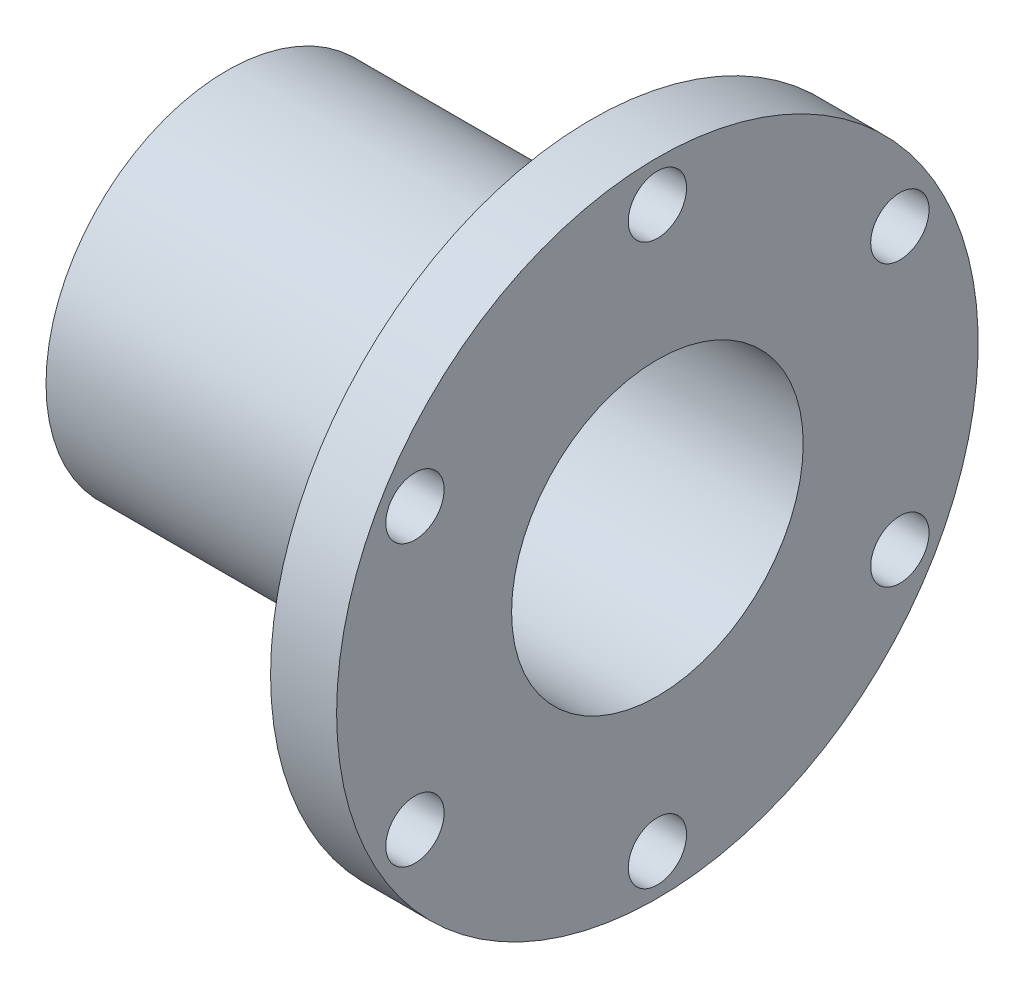
ISO-10303-21;
HEADER;
FILE_DESCRIPTION(('STEP AP214'),'2;1');
FILE_NAME('part.step','',(''),(''),'','','');
FILE_SCHEMA(('AUTOMOTIVE_DESIGN { 1 0 10303 214 1 1 1 1 }'));
ENDSEC;
DATA;
#1=APPLICATION_CONTEXT('core data for automotive mechanical design processes');
#2=APPLICATION_PROTOCOL_DEFINITION('international standard','automotive_design',2000,#1);
#3=PRODUCT_CONTEXT('',#1,'mechanical');
#4=PRODUCT('Part','Part','',(#3));
#5=PRODUCT_RELATED_PRODUCT_CATEGORY('part','',(#4));
#6=PRODUCT_DEFINITION_FORMATION('','',#4);
#7=PRODUCT_DEFINITION_CONTEXT('part definition',#1,'design');
#8=PRODUCT_DEFINITION('design','',#6,#7);
#9=PRODUCT_DEFINITION_SHAPE('','',#8);
#10=(LENGTH_UNIT() NAMED_UNIT(*) SI_UNIT(.MILLI.,.METRE.));
#11=(NAMED_UNIT(*) PLANE_ANGLE_UNIT() SI_UNIT($,.RADIAN.));
#12=(NAMED_UNIT(*) SI_UNIT($,.STERADIAN.) SOLID_ANGLE_UNIT());
#13=UNCERTAINTY_MEASURE_WITH_UNIT(LENGTH_MEASURE(1.E-05),#10,'distance_accuracy_value','');
#14=(GEOMETRIC_REPRESENTATION_CONTEXT(3) GLOBAL_UNCERTAINTY_ASSIGNED_CONTEXT((#13)) GLOBAL_UNIT_ASSIGNED_CONTEXT((#10,
#11,#12)) REPRESENTATION_CONTEXT('',''));
#15=CARTESIAN_POINT('',(0.,0.,0.));
#16=DIRECTION('',(0.,0.,1.));
#17=DIRECTION('',(1.,0.,0.));
#18=AXIS2_PLACEMENT_3D('',#15,#16,#17);
#19=CARTESIAN_POINT('',(-22.6457399103139,110.,0.));
#20=DIRECTION('',(1.,0.,0.));
#21=DIRECTION('',(0.,0.,-1.));
#22=AXIS2_PLACEMENT_3D('',#19,#20,#21);
#23=PLANE('',#22);
#24=CARTESIAN_POINT('',(-22.6457399103139,48.000000000001,-83.1384387633056));
#25=DIRECTION('',(1.,0.,0.));
#26=DIRECTION('',(0.,0.,-1.));
#27=AXIS2_PLACEMENT_3D('',#24,#25,#26);
#28=CIRCLE('',#27,10.);
#29=CARTESIAN_POINT('',(-22.6457399103139,48.000000000001,-93.1384387633055));
#30=VERTEX_POINT('',#29);
#31=EDGE_CURVE('E69',#30,#30,#28,.T.);
#32=ORIENTED_EDGE('',*,*,#31,.T.);
#33=EDGE_LOOP('',(#32));
#34=FACE_BOUND('',#33,.T.);
#35=CARTESIAN_POINT('',(-22.6457399103139,-47.9999999999992,-83.1384387633066));
#36=DIRECTION('',(1.,0.,0.));
#37=DIRECTION('',(0.,0.,-1.));
#38=AXIS2_PLACEMENT_3D('',#35,#36,#37);
#39=CIRCLE('',#38,10.);
#40=CARTESIAN_POINT('',(-22.6457399103139,-47.9999999999992,-93.1384387633066));
#41=VERTEX_POINT('',#40);
#42=EDGE_CURVE('E72',#41,#41,#39,.T.);
#43=ORIENTED_EDGE('',*,*,#42,.T.);
#44=EDGE_LOOP('',(#43));
#45=FACE_BOUND('',#44,.T.);
#46=CARTESIAN_POINT('',(-22.6457399103139,-96.,0.));
#47=DIRECTION('',(1.,0.,0.));
#48=DIRECTION('',(0.,0.,-1.));
#49=AXIS2_PLACEMENT_3D('',#46,#47,#48);
#50=CIRCLE('',#49,10.);
#51=CARTESIAN_POINT('',(-22.6457399103139,-96.,-10.));
#52=VERTEX_POINT('',#51);
#53=EDGE_CURVE('E75',#52,#52,#50,.T.);
#54=ORIENTED_EDGE('',*,*,#53,.T.);
#55=EDGE_LOOP('',(#54));
#56=FACE_BOUND('',#55,.T.);
#57=CARTESIAN_POINT('',(-22.6457399103139,-48.0000000000004,83.1384387633059));
#58=DIRECTION('',(1.,0.,0.));
#59=DIRECTION('',(0.,0.,-1.));
#60=AXIS2_PLACEMENT_3D('',#57,#58,#59);
#61=CIRCLE('',#60,10.);
#62=CARTESIAN_POINT('',(-22.6457399103139,-48.0000000000004,73.1384387633059));
#63=VERTEX_POINT('',#62);
#64=EDGE_CURVE('E78',#63,#63,#61,.T.);
#65=ORIENTED_EDGE('',*,*,#64,.T.);
#66=EDGE_LOOP('',(#65));
#67=FACE_BOUND('',#66,.T.);
#68=CARTESIAN_POINT('',(-22.6457399103139,47.9999999999998,83.1384387633062));
#69=DIRECTION('',(1.,0.,0.));
#70=DIRECTION('',(0.,0.,-1.));
#71=AXIS2_PLACEMENT_3D('',#68,#69,#70);
#72=CIRCLE('',#71,10.);
#73=CARTESIAN_POINT('',(-22.6457399103139,47.9999999999998,73.1384387633062));
#74=VERTEX_POINT('',#73);
#75=EDGE_CURVE('E81',#74,#74,#72,.T.);
#76=ORIENTED_EDGE('',*,*,#75,.T.);
#77=EDGE_LOOP('',(#76));
#78=FACE_BOUND('',#77,.T.);
#79=CARTESIAN_POINT('',(-22.6457399103139,96.,0.));
#80=DIRECTION('',(1.,0.,0.));
#81=DIRECTION('',(0.,0.,-1.));
#82=AXIS2_PLACEMENT_3D('',#79,#80,#81);
#83=CIRCLE('',#82,10.);
#84=CARTESIAN_POINT('',(-22.6457399103139,96.,-10.));
#85=VERTEX_POINT('',#84);
#86=EDGE_CURVE('E63',#85,#85,#83,.T.);
#87=ORIENTED_EDGE('',*,*,#86,.T.);
#88=EDGE_LOOP('',(#87));
#89=FACE_BOUND('',#88,.T.);
#90=CARTESIAN_POINT('',(-22.6457399103139,0.,0.));
#91=DIRECTION('',(-1.,0.,0.));
#92=DIRECTION('',(0.,0.,1.));
#93=AXIS2_PLACEMENT_3D('',#90,#91,#92);
#94=CIRCLE('',#93,62.);
#95=CARTESIAN_POINT('',(-22.6457399103139,0.,62.));
#96=VERTEX_POINT('',#95);
#97=EDGE_CURVE('E60',#96,#96,#94,.T.);
#98=ORIENTED_EDGE('',*,*,#97,.F.);
#99=EDGE_LOOP('',(#98));
#100=FACE_BOUND('',#99,.T.);
#101=CARTESIAN_POINT('',(-22.6457399103139,0.,0.));
#102=DIRECTION('',(-1.,0.,0.));
#103=DIRECTION('',(0.,0.,1.));
#104=AXIS2_PLACEMENT_3D('',#101,#102,#103);
#105=CIRCLE('',#104,110.);
#106=CARTESIAN_POINT('',(-22.6457399103139,0.,110.));
#107=VERTEX_POINT('',#106);
#108=EDGE_CURVE('E10',#107,#107,#105,.T.);
#109=ORIENTED_EDGE('',*,*,#108,.T.);
#110=EDGE_LOOP('',(#109));
#111=FACE_BOUND('',#110,.T.);
#112=ADVANCED_FACE('F38',(#34,#45,#56,#67,#78,#89,#100,#111),#23,.F.);
#113=CARTESIAN_POINT('',(-203.363228699552,0.,0.));
#114=DIRECTION('',(-1.,0.,0.));
#115=DIRECTION('',(0.,0.,1.));
#116=AXIS2_PLACEMENT_3D('',#113,#114,#115);
#117=CYLINDRICAL_SURFACE('',#116,110.);
#118=ORIENTED_EDGE('',*,*,#108,.F.);
#119=EDGE_LOOP('',(#118));
#120=FACE_BOUND('',#119,.T.);
#121=CARTESIAN_POINT('',(0.,0.,0.));
#122=DIRECTION('',(-1.,0.,0.));
#123=DIRECTION('',(0.,0.,1.));
#124=AXIS2_PLACEMENT_3D('',#121,#122,#123);
#125=CIRCLE('',#124,110.);
#126=CARTESIAN_POINT('',(0.,0.,110.));
#127=VERTEX_POINT('',#126);
#128=EDGE_CURVE('E44',#127,#127,#125,.T.);
#129=ORIENTED_EDGE('',*,*,#128,.T.);
#130=EDGE_LOOP('',(#129));
#131=FACE_BOUND('',#130,.T.);
#132=ADVANCED_FACE('F107',(#120,#131),#117,.T.);
#133=CARTESIAN_POINT('',(0.,50.,0.));
#134=DIRECTION('',(-1.,0.,0.));
#135=DIRECTION('',(0.,0.,1.));
#136=AXIS2_PLACEMENT_3D('',#133,#134,#135);
#137=PLANE('',#136);
#138=CARTESIAN_POINT('',(0.,48.000000000001,-83.1384387633056));
#139=DIRECTION('',(1.,0.,0.));
#140=DIRECTION('',(0.,-0.866025403784433,-0.50000000000001));
#141=AXIS2_PLACEMENT_3D('',#138,#139,#140);
#142=CIRCLE('',#141,10.);
#143=CARTESIAN_POINT('',(0.,39.3397459621566,-88.1384387633057));
#144=VERTEX_POINT('',#143);
#145=EDGE_CURVE('E88',#144,#144,#142,.T.);
#146=ORIENTED_EDGE('',*,*,#145,.F.);
#147=EDGE_LOOP('',(#146));
#148=FACE_BOUND('',#147,.T.);
#149=CARTESIAN_POINT('',(0.,-47.9999999999992,-83.1384387633066));
#150=DIRECTION('',(1.,0.,0.));
#151=DIRECTION('',(0.,-0.866025403784443,0.499999999999992));
#152=AXIS2_PLACEMENT_3D('',#149,#150,#151);
#153=CIRCLE('',#152,10.);
#154=CARTESIAN_POINT('',(0.,-56.6602540378437,-78.1384387633066));
#155=VERTEX_POINT('',#154);
#156=EDGE_CURVE('E91',#155,#155,#153,.T.);
#157=ORIENTED_EDGE('',*,*,#156,.F.);
#158=EDGE_LOOP('',(#157));
#159=FACE_BOUND('',#158,.T.);
#160=CARTESIAN_POINT('',(0.,-96.,0.));
#161=DIRECTION('',(1.,0.,0.));
#162=DIRECTION('',(0.,0.,1.));
#163=AXIS2_PLACEMENT_3D('',#160,#161,#162);
#164=CIRCLE('',#163,10.);
#165=CARTESIAN_POINT('',(0.,-96.,10.));
#166=VERTEX_POINT('',#165);
#167=EDGE_CURVE('E94',#166,#166,#164,.T.);
#168=ORIENTED_EDGE('',*,*,#167,.F.);
#169=EDGE_LOOP('',(#168));
#170=FACE_BOUND('',#169,.T.);
#171=CARTESIAN_POINT('',(0.,-48.0000000000004,83.1384387633059));
#172=DIRECTION('',(1.,0.,0.));
#173=DIRECTION('',(0.,0.866025403784436,0.500000000000004));
#174=AXIS2_PLACEMENT_3D('',#171,#172,#173);
#175=CIRCLE('',#174,10.);
#176=CARTESIAN_POINT('',(0.,-39.339745962156,88.1384387633059));
#177=VERTEX_POINT('',#176);
#178=EDGE_CURVE('E87',#177,#177,#175,.T.);
#179=ORIENTED_EDGE('',*,*,#178,.F.);
#180=EDGE_LOOP('',(#179));
#181=FACE_BOUND('',#180,.T.);
#182=CARTESIAN_POINT('',(0.,47.9999999999998,83.1384387633062));
#183=DIRECTION('',(1.,0.,0.));
#184=DIRECTION('',(0.,0.86602540378444,-0.499999999999998));
#185=AXIS2_PLACEMENT_3D('',#182,#183,#184);
#186=CIRCLE('',#185,10.);
#187=CARTESIAN_POINT('',(0.,56.6602540378442,78.1384387633062));
#188=VERTEX_POINT('',#187);
#189=EDGE_CURVE('E84',#188,#188,#186,.T.);
#190=ORIENTED_EDGE('',*,*,#189,.F.);
#191=EDGE_LOOP('',(#190));
#192=FACE_BOUND('',#191,.T.);
#193=CARTESIAN_POINT('',(0.,96.,0.));
#194=DIRECTION('',(1.,0.,0.));
#195=DIRECTION('',(0.,0.,-1.));
#196=AXIS2_PLACEMENT_3D('',#193,#194,#195);
#197=CIRCLE('',#196,10.);
#198=CARTESIAN_POINT('',(0.,96.,-10.));
#199=VERTEX_POINT('',#198);
#200=EDGE_CURVE('E66',#199,#199,#197,.T.);
#201=ORIENTED_EDGE('',*,*,#200,.F.);
#202=EDGE_LOOP('',(#201));
#203=FACE_BOUND('',#202,.T.);
#204=ORIENTED_EDGE('',*,*,#128,.F.);
#205=EDGE_LOOP('',(#204));
#206=FACE_BOUND('',#205,.T.);
#207=CARTESIAN_POINT('',(0.,0.,0.));
#208=DIRECTION('',(-1.,0.,0.));
#209=DIRECTION('',(0.,0.,1.));
#210=AXIS2_PLACEMENT_3D('',#207,#208,#209);
#211=CIRCLE('',#210,50.);
#212=CARTESIAN_POINT('',(0.,0.,50.));
#213=VERTEX_POINT('',#212);
#214=EDGE_CURVE('E48',#213,#213,#211,.T.);
#215=ORIENTED_EDGE('',*,*,#214,.T.);
#216=EDGE_LOOP('',(#215));
#217=FACE_BOUND('',#216,.T.);
#218=ADVANCED_FACE('F103',(#148,#159,#170,#181,#192,#203,#206,#217),#137,.F.);
#219=CARTESIAN_POINT('',(-203.363228699552,0.,0.));
#220=DIRECTION('',(-1.,0.,0.));
#221=DIRECTION('',(0.,0.,1.));
#222=AXIS2_PLACEMENT_3D('',#219,#220,#221);
#223=CYLINDRICAL_SURFACE('',#222,50.);
#224=ORIENTED_EDGE('',*,*,#214,.F.);
#225=EDGE_LOOP('',(#224));
#226=FACE_BOUND('',#225,.T.);
#227=CARTESIAN_POINT('',(-147.645739910314,0.,0.));
#228=DIRECTION('',(-1.,0.,0.));
#229=DIRECTION('',(0.,0.,1.));
#230=AXIS2_PLACEMENT_3D('',#227,#228,#229);
#231=CIRCLE('',#230,50.);
#232=CARTESIAN_POINT('',(-147.645739910314,0.,50.));
#233=VERTEX_POINT('',#232);
#234=EDGE_CURVE('E52',#233,#233,#231,.T.);
#235=ORIENTED_EDGE('',*,*,#234,.T.);
#236=EDGE_LOOP('',(#235));
#237=FACE_BOUND('',#236,.T.);
#238=ADVANCED_FACE('F106',(#226,#237),#223,.F.);
#239=CARTESIAN_POINT('',(-147.645739910314,62.,0.));
#240=DIRECTION('',(1.,0.,0.));
#241=DIRECTION('',(0.,0.,-1.));
#242=AXIS2_PLACEMENT_3D('',#239,#240,#241);
#243=PLANE('',#242);
#244=ORIENTED_EDGE('',*,*,#234,.F.);
#245=EDGE_LOOP('',(#244));
#246=FACE_BOUND('',#245,.T.);
#247=CARTESIAN_POINT('',(-147.645739910314,0.,0.));
#248=DIRECTION('',(-1.,0.,0.));
#249=DIRECTION('',(0.,0.,1.));
#250=AXIS2_PLACEMENT_3D('',#247,#248,#249);
#251=CIRCLE('',#250,62.);
#252=CARTESIAN_POINT('',(-147.645739910314,0.,62.));
#253=VERTEX_POINT('',#252);
#254=EDGE_CURVE('E57',#253,#253,#251,.T.);
#255=ORIENTED_EDGE('',*,*,#254,.T.);
#256=EDGE_LOOP('',(#255));
#257=FACE_BOUND('',#256,.T.);
#258=ADVANCED_FACE('F119',(#246,#257),#243,.F.);
#259=CARTESIAN_POINT('',(-203.363228699552,0.,0.));
#260=DIRECTION('',(-1.,0.,0.));
#261=DIRECTION('',(0.,0.,1.));
#262=AXIS2_PLACEMENT_3D('',#259,#260,#261);
#263=CYLINDRICAL_SURFACE('',#262,62.);
#264=ORIENTED_EDGE('',*,*,#254,.F.);
#265=EDGE_LOOP('',(#264));
#266=FACE_BOUND('',#265,.T.);
#267=ORIENTED_EDGE('',*,*,#97,.T.);
#268=EDGE_LOOP('',(#267));
#269=FACE_BOUND('',#268,.T.);
#270=ADVANCED_FACE('F125',(#266,#269),#263,.T.);
#271=CARTESIAN_POINT('',(-30.,96.,0.));
#272=DIRECTION('',(1.,0.,0.));
#273=DIRECTION('',(0.,0.,-1.));
#274=AXIS2_PLACEMENT_3D('',#271,#272,#273);
#275=CYLINDRICAL_SURFACE('',#274,10.);
#276=ORIENTED_EDGE('',*,*,#200,.T.);
#277=EDGE_LOOP('',(#276));
#278=FACE_BOUND('',#277,.T.);
#279=ORIENTED_EDGE('',*,*,#86,.F.);
#280=EDGE_LOOP('',(#279));
#281=FACE_BOUND('',#280,.T.);
#282=ADVANCED_FACE('F131',(#278,#281),#275,.F.);
#283=CARTESIAN_POINT('',(-30.,47.9999999999998,83.1384387633062));
#284=DIRECTION('',(1.,0.,0.));
#285=DIRECTION('',(0.,0.,-1.));
#286=AXIS2_PLACEMENT_3D('',#283,#284,#285);
#287=CYLINDRICAL_SURFACE('',#286,10.);
#288=ORIENTED_EDGE('',*,*,#189,.T.);
#289=EDGE_LOOP('',(#288));
#290=FACE_BOUND('',#289,.T.);
#291=ORIENTED_EDGE('',*,*,#75,.F.);
#292=EDGE_LOOP('',(#291));
#293=FACE_BOUND('',#292,.T.);
#294=ADVANCED_FACE('F154',(#290,#293),#287,.F.);
#295=CARTESIAN_POINT('',(-30.,-48.0000000000004,83.1384387633059));
#296=DIRECTION('',(1.,0.,0.));
#297=DIRECTION('',(0.,0.,-1.));
#298=AXIS2_PLACEMENT_3D('',#295,#296,#297);
#299=CYLINDRICAL_SURFACE('',#298,10.);
#300=ORIENTED_EDGE('',*,*,#178,.T.);
#301=EDGE_LOOP('',(#300));
#302=FACE_BOUND('',#301,.T.);
#303=ORIENTED_EDGE('',*,*,#64,.F.);
#304=EDGE_LOOP('',(#303));
#305=FACE_BOUND('',#304,.T.);
#306=ADVANCED_FACE('F100',(#302,#305),#299,.F.);
#307=CARTESIAN_POINT('',(-30.,-96.,0.));
#308=DIRECTION('',(1.,0.,0.));
#309=DIRECTION('',(0.,0.,-1.));
#310=AXIS2_PLACEMENT_3D('',#307,#308,#309);
#311=CYLINDRICAL_SURFACE('',#310,10.);
#312=ORIENTED_EDGE('',*,*,#167,.T.);
#313=EDGE_LOOP('',(#312));
#314=FACE_BOUND('',#313,.T.);
#315=ORIENTED_EDGE('',*,*,#53,.F.);
#316=EDGE_LOOP('',(#315));
#317=FACE_BOUND('',#316,.T.);
#318=ADVANCED_FACE('F170',(#314,#317),#311,.F.);
#319=CARTESIAN_POINT('',(-30.,-47.9999999999992,-83.1384387633066));
#320=DIRECTION('',(1.,0.,0.));
#321=DIRECTION('',(0.,0.,-1.));
#322=AXIS2_PLACEMENT_3D('',#319,#320,#321);
#323=CYLINDRICAL_SURFACE('',#322,10.);
#324=ORIENTED_EDGE('',*,*,#156,.T.);
#325=EDGE_LOOP('',(#324));
#326=FACE_BOUND('',#325,.T.);
#327=ORIENTED_EDGE('',*,*,#42,.F.);
#328=EDGE_LOOP('',(#327));
#329=FACE_BOUND('',#328,.T.);
#330=ADVANCED_FACE('F166',(#326,#329),#323,.F.);
#331=CARTESIAN_POINT('',(-30.,48.000000000001,-83.1384387633056));
#332=DIRECTION('',(1.,0.,0.));
#333=DIRECTION('',(0.,0.,-1.));
#334=AXIS2_PLACEMENT_3D('',#331,#332,#333);
#335=CYLINDRICAL_SURFACE('',#334,10.);
#336=ORIENTED_EDGE('',*,*,#145,.T.);
#337=EDGE_LOOP('',(#336));
#338=FACE_BOUND('',#337,.T.);
#339=ORIENTED_EDGE('',*,*,#31,.F.);
#340=EDGE_LOOP('',(#339));
#341=FACE_BOUND('',#340,.T.);
#342=ADVANCED_FACE('F163',(#338,#341),#335,.F.);
#343=CLOSED_SHELL('',(#112,#132,#218,#238,#258,#270,#282,#294,#306,#318,#330,#342));
#344=MANIFOLD_SOLID_BREP('B2',#343);
#345=ADVANCED_BREP_SHAPE_REPRESENTATION('',(#18,#344),#14);
#346=SHAPE_DEFINITION_REPRESENTATION(#9,#345);
ENDSEC;
END-ISO-10303-21;
